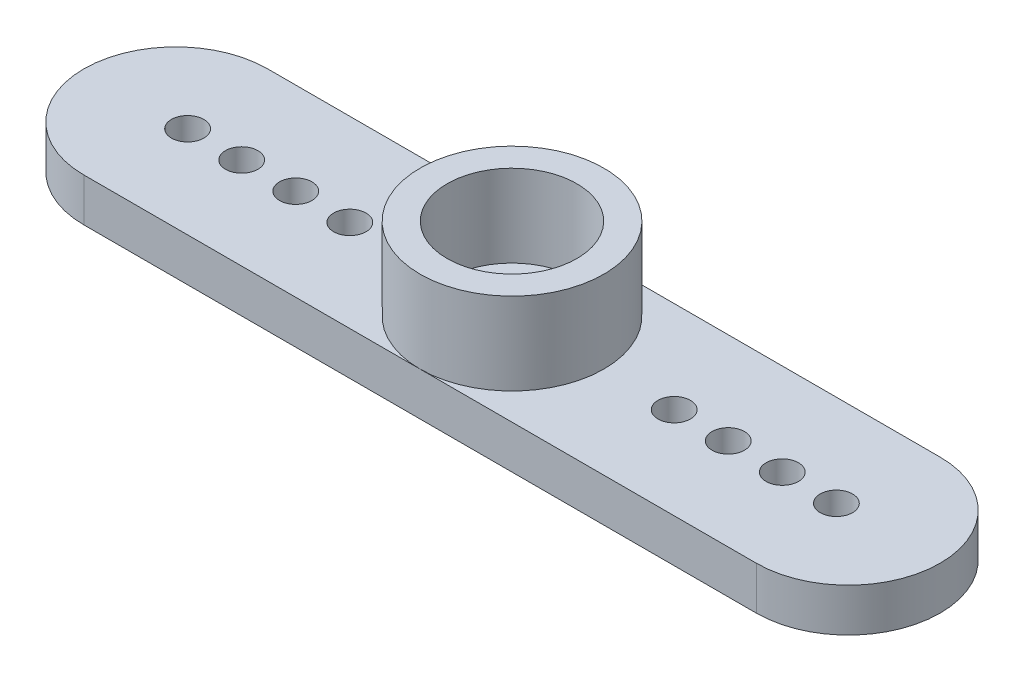
ISO-10303-21;
HEADER;
FILE_DESCRIPTION(('STEP AP214'),'2;1');
FILE_NAME('part.step','',(''),(''),'','','');
FILE_SCHEMA(('AUTOMOTIVE_DESIGN { 1 0 10303 214 1 1 1 1 }'));
ENDSEC;
DATA;
#1=APPLICATION_CONTEXT('core data for automotive mechanical design processes');
#2=APPLICATION_PROTOCOL_DEFINITION('international standard','automotive_design',2000,#1);
#3=PRODUCT_CONTEXT('',#1,'mechanical');
#4=PRODUCT('Part','Part','',(#3));
#5=PRODUCT_RELATED_PRODUCT_CATEGORY('part','',(#4));
#6=PRODUCT_DEFINITION_FORMATION('','',#4);
#7=PRODUCT_DEFINITION_CONTEXT('part definition',#1,'design');
#8=PRODUCT_DEFINITION('design','',#6,#7);
#9=PRODUCT_DEFINITION_SHAPE('','',#8);
#10=(LENGTH_UNIT() NAMED_UNIT(*) SI_UNIT(.MILLI.,.METRE.));
#11=(NAMED_UNIT(*) PLANE_ANGLE_UNIT() SI_UNIT($,.RADIAN.));
#12=(NAMED_UNIT(*) SI_UNIT($,.STERADIAN.) SOLID_ANGLE_UNIT());
#13=UNCERTAINTY_MEASURE_WITH_UNIT(LENGTH_MEASURE(1.E-05),#10,'distance_accuracy_value','');
#14=(GEOMETRIC_REPRESENTATION_CONTEXT(3) GLOBAL_UNCERTAINTY_ASSIGNED_CONTEXT((#13)) GLOBAL_UNIT_ASSIGNED_CONTEXT((#10,
#11,#12)) REPRESENTATION_CONTEXT('',''));
#15=CARTESIAN_POINT('',(0.,0.,0.));
#16=DIRECTION('',(0.,0.,1.));
#17=DIRECTION('',(1.,0.,0.));
#18=AXIS2_PLACEMENT_3D('',#15,#16,#17);
#19=CARTESIAN_POINT('',(0.,2.,0.));
#20=DIRECTION('',(0.,1.,0.));
#21=DIRECTION('',(0.,0.,1.));
#22=AXIS2_PLACEMENT_3D('',#19,#20,#21);
#23=PLANE('',#22);
#24=CARTESIAN_POINT('',(15.55,2.,0.));
#25=DIRECTION('',(0.,1.,0.));
#26=DIRECTION('',(0.,0.,1.));
#27=AXIS2_PLACEMENT_3D('',#24,#25,#26);
#28=CIRCLE('',#27,4.25);
#29=CARTESIAN_POINT('',(15.55,2.,4.25));
#30=VERTEX_POINT('',#29);
#31=CARTESIAN_POINT('',(15.55,2.,-4.25));
#32=VERTEX_POINT('',#31);
#33=EDGE_CURVE('E45',#30,#32,#28,.T.);
#34=ORIENTED_EDGE('',*,*,#33,.F.);
#35=DIRECTION('',(1.,0.,0.));
#36=VECTOR('',#35,1.);
#37=CARTESIAN_POINT('',(0.,2.,4.25));
#38=LINE('',#37,#36);
#39=CARTESIAN_POINT('',(31.1,2.,4.25));
#40=VERTEX_POINT('',#39);
#41=EDGE_CURVE('E93',#30,#40,#38,.T.);
#42=ORIENTED_EDGE('',*,*,#41,.T.);
#43=CARTESIAN_POINT('',(31.1,2.,0.));
#44=DIRECTION('',(0.,1.,0.));
#45=DIRECTION('',(0.,0.,1.));
#46=AXIS2_PLACEMENT_3D('',#43,#44,#45);
#47=CIRCLE('',#46,4.25);
#48=CARTESIAN_POINT('',(31.1,2.,-4.25));
#49=VERTEX_POINT('',#48);
#50=EDGE_CURVE('E92',#40,#49,#47,.T.);
#51=ORIENTED_EDGE('',*,*,#50,.T.);
#52=DIRECTION('',(-1.,0.,0.));
#53=VECTOR('',#52,1.);
#54=CARTESIAN_POINT('',(0.,2.,-4.25));
#55=LINE('',#54,#53);
#56=EDGE_CURVE('E106',#49,#32,#55,.T.);
#57=ORIENTED_EDGE('',*,*,#56,.T.);
#58=EDGE_LOOP('',(#34,#42,#51,#57));
#59=FACE_BOUND('',#58,.T.);
#60=CARTESIAN_POINT('',(28.05,2.,0.));
#61=DIRECTION('',(0.,1.,0.));
#62=DIRECTION('',(0.,0.,1.));
#63=AXIS2_PLACEMENT_3D('',#60,#61,#62);
#64=CIRCLE('',#63,0.750000000000002);
#65=CARTESIAN_POINT('',(28.05,2.,0.750000000000002));
#66=VERTEX_POINT('',#65);
#67=EDGE_CURVE('E189',#66,#66,#64,.T.);
#68=ORIENTED_EDGE('',*,*,#67,.F.);
#69=EDGE_LOOP('',(#68));
#70=FACE_BOUND('',#69,.T.);
#71=CARTESIAN_POINT('',(23.05,2.,0.));
#72=DIRECTION('',(0.,1.,0.));
#73=DIRECTION('',(0.,0.,1.));
#74=AXIS2_PLACEMENT_3D('',#71,#72,#73);
#75=CIRCLE('',#74,0.750000000000002);
#76=CARTESIAN_POINT('',(23.05,2.,0.750000000000002));
#77=VERTEX_POINT('',#76);
#78=EDGE_CURVE('E178',#77,#77,#75,.T.);
#79=ORIENTED_EDGE('',*,*,#78,.F.);
#80=EDGE_LOOP('',(#79));
#81=FACE_BOUND('',#80,.T.);
#82=CARTESIAN_POINT('',(25.55,2.,0.));
#83=DIRECTION('',(0.,1.,0.));
#84=DIRECTION('',(0.,0.,1.));
#85=AXIS2_PLACEMENT_3D('',#82,#83,#84);
#86=CIRCLE('',#85,0.750000000000002);
#87=CARTESIAN_POINT('',(25.55,2.,0.750000000000002));
#88=VERTEX_POINT('',#87);
#89=EDGE_CURVE('E183',#88,#88,#86,.T.);
#90=ORIENTED_EDGE('',*,*,#89,.F.);
#91=EDGE_LOOP('',(#90));
#92=FACE_BOUND('',#91,.T.);
#93=CARTESIAN_POINT('',(30.55,2.,0.));
#94=DIRECTION('',(0.,1.,0.));
#95=DIRECTION('',(0.,0.,1.));
#96=AXIS2_PLACEMENT_3D('',#93,#94,#95);
#97=CIRCLE('',#96,0.750000000000005);
#98=CARTESIAN_POINT('',(30.55,2.,0.750000000000005));
#99=VERTEX_POINT('',#98);
#100=EDGE_CURVE('E195',#99,#99,#97,.T.);
#101=ORIENTED_EDGE('',*,*,#100,.F.);
#102=EDGE_LOOP('',(#101));
#103=FACE_BOUND('',#102,.T.);
#104=ADVANCED_FACE('F35',(#59,#70,#81,#92,#103),#23,.T.);
#105=EDGE_CURVE('E11',#32,#30,#28,.T.);
#106=ORIENTED_EDGE('',*,*,#105,.F.);
#107=CARTESIAN_POINT('',(0.,2.,-4.25));
#108=VERTEX_POINT('',#107);
#109=EDGE_CURVE('E55',#32,#108,#55,.T.);
#110=ORIENTED_EDGE('',*,*,#109,.T.);
#111=CARTESIAN_POINT('',(0.,2.,0.));
#112=DIRECTION('',(0.,1.,0.));
#113=DIRECTION('',(0.,0.,1.));
#114=AXIS2_PLACEMENT_3D('',#111,#112,#113);
#115=CIRCLE('',#114,4.25);
#116=CARTESIAN_POINT('',(0.,2.,4.25));
#117=VERTEX_POINT('',#116);
#118=EDGE_CURVE('E90',#108,#117,#115,.T.);
#119=ORIENTED_EDGE('',*,*,#118,.T.);
#120=EDGE_CURVE('E84',#117,#30,#38,.T.);
#121=ORIENTED_EDGE('',*,*,#120,.T.);
#122=EDGE_LOOP('',(#106,#110,#119,#121));
#123=FACE_BOUND('',#122,.T.);
#124=CARTESIAN_POINT('',(3.05,2.,0.));
#125=DIRECTION('',(0.,1.,0.));
#126=DIRECTION('',(0.,0.,1.));
#127=AXIS2_PLACEMENT_3D('',#124,#125,#126);
#128=CIRCLE('',#127,0.75);
#129=CARTESIAN_POINT('',(3.05,2.,0.750000000000035));
#130=VERTEX_POINT('',#129);
#131=EDGE_CURVE('E207',#130,#130,#128,.T.);
#132=ORIENTED_EDGE('',*,*,#131,.F.);
#133=EDGE_LOOP('',(#132));
#134=FACE_BOUND('',#133,.T.);
#135=CARTESIAN_POINT('',(8.05,2.,0.));
#136=DIRECTION('',(0.,1.,0.));
#137=DIRECTION('',(0.,0.,1.));
#138=AXIS2_PLACEMENT_3D('',#135,#136,#137);
#139=CIRCLE('',#138,0.75);
#140=CARTESIAN_POINT('',(8.05,2.,0.75));
#141=VERTEX_POINT('',#140);
#142=EDGE_CURVE('E158',#141,#141,#139,.T.);
#143=ORIENTED_EDGE('',*,*,#142,.F.);
#144=EDGE_LOOP('',(#143));
#145=FACE_BOUND('',#144,.T.);
#146=CARTESIAN_POINT('',(5.55,2.,0.));
#147=DIRECTION('',(0.,1.,0.));
#148=DIRECTION('',(0.,0.,1.));
#149=AXIS2_PLACEMENT_3D('',#146,#147,#148);
#150=CIRCLE('',#149,0.75);
#151=CARTESIAN_POINT('',(5.55,2.,0.750000000000018));
#152=VERTEX_POINT('',#151);
#153=EDGE_CURVE('E201',#152,#152,#150,.T.);
#154=ORIENTED_EDGE('',*,*,#153,.F.);
#155=EDGE_LOOP('',(#154));
#156=FACE_BOUND('',#155,.T.);
#157=CARTESIAN_POINT('',(0.550000000000004,2.,0.));
#158=DIRECTION('',(0.,1.,0.));
#159=DIRECTION('',(0.,0.,1.));
#160=AXIS2_PLACEMENT_3D('',#157,#158,#159);
#161=CIRCLE('',#160,0.75);
#162=CARTESIAN_POINT('',(0.550000000000004,2.,0.750000000000053));
#163=VERTEX_POINT('',#162);
#164=EDGE_CURVE('E213',#163,#163,#161,.T.);
#165=ORIENTED_EDGE('',*,*,#164,.F.);
#166=EDGE_LOOP('',(#165));
#167=FACE_BOUND('',#166,.T.);
#168=ADVANCED_FACE('F87',(#123,#134,#145,#156,#167),#23,.T.);
#169=CARTESIAN_POINT('',(0.,0.,0.));
#170=DIRECTION('',(0.,1.,0.));
#171=DIRECTION('',(0.,0.,1.));
#172=AXIS2_PLACEMENT_3D('',#169,#170,#171);
#173=PLANE('',#172);
#174=CARTESIAN_POINT('',(0.,0.,0.));
#175=DIRECTION('',(0.,1.,0.));
#176=DIRECTION('',(0.,0.,1.));
#177=AXIS2_PLACEMENT_3D('',#174,#175,#176);
#178=CIRCLE('',#177,4.25);
#179=CARTESIAN_POINT('',(0.,0.,-4.25));
#180=VERTEX_POINT('',#179);
#181=CARTESIAN_POINT('',(0.,0.,4.25));
#182=VERTEX_POINT('',#181);
#183=EDGE_CURVE('E155',#180,#182,#178,.T.);
#184=ORIENTED_EDGE('',*,*,#183,.F.);
#185=DIRECTION('',(-1.,0.,0.));
#186=VECTOR('',#185,1.);
#187=CARTESIAN_POINT('',(0.,0.,-4.25));
#188=LINE('',#187,#186);
#189=CARTESIAN_POINT('',(31.1,0.,-4.25));
#190=VERTEX_POINT('',#189);
#191=EDGE_CURVE('E77',#190,#180,#188,.T.);
#192=ORIENTED_EDGE('',*,*,#191,.F.);
#193=CARTESIAN_POINT('',(31.1,0.,0.));
#194=DIRECTION('',(0.,1.,0.));
#195=DIRECTION('',(0.,0.,1.));
#196=AXIS2_PLACEMENT_3D('',#193,#194,#195);
#197=CIRCLE('',#196,4.25);
#198=CARTESIAN_POINT('',(31.1,0.,4.25));
#199=VERTEX_POINT('',#198);
#200=EDGE_CURVE('E160',#199,#190,#197,.T.);
#201=ORIENTED_EDGE('',*,*,#200,.F.);
#202=DIRECTION('',(1.,0.,0.));
#203=VECTOR('',#202,1.);
#204=CARTESIAN_POINT('',(0.,0.,4.25));
#205=LINE('',#204,#203);
#206=EDGE_CURVE('E157',#182,#199,#205,.T.);
#207=ORIENTED_EDGE('',*,*,#206,.F.);
#208=EDGE_LOOP('',(#184,#192,#201,#207));
#209=FACE_BOUND('',#208,.T.);
#210=CARTESIAN_POINT('',(8.05,0.,0.));
#211=DIRECTION('',(0.,1.,0.));
#212=DIRECTION('',(0.,0.,1.));
#213=AXIS2_PLACEMENT_3D('',#210,#211,#212);
#214=CIRCLE('',#213,0.75);
#215=CARTESIAN_POINT('',(8.05,0.,0.75));
#216=VERTEX_POINT('',#215);
#217=EDGE_CURVE('E163',#216,#216,#214,.T.);
#218=ORIENTED_EDGE('',*,*,#217,.T.);
#219=EDGE_LOOP('',(#218));
#220=FACE_BOUND('',#219,.T.);
#221=CARTESIAN_POINT('',(23.05,0.,0.));
#222=DIRECTION('',(0.,1.,0.));
#223=DIRECTION('',(0.,0.,1.));
#224=AXIS2_PLACEMENT_3D('',#221,#222,#223);
#225=CIRCLE('',#224,0.750000000000002);
#226=CARTESIAN_POINT('',(23.05,0.,0.750000000000002));
#227=VERTEX_POINT('',#226);
#228=EDGE_CURVE('E180',#227,#227,#225,.T.);
#229=ORIENTED_EDGE('',*,*,#228,.T.);
#230=EDGE_LOOP('',(#229));
#231=FACE_BOUND('',#230,.T.);
#232=CARTESIAN_POINT('',(25.55,0.,0.));
#233=DIRECTION('',(0.,1.,0.));
#234=DIRECTION('',(0.,0.,1.));
#235=AXIS2_PLACEMENT_3D('',#232,#233,#234);
#236=CIRCLE('',#235,0.750000000000002);
#237=CARTESIAN_POINT('',(25.55,0.,0.750000000000002));
#238=VERTEX_POINT('',#237);
#239=EDGE_CURVE('E186',#238,#238,#236,.T.);
#240=ORIENTED_EDGE('',*,*,#239,.T.);
#241=EDGE_LOOP('',(#240));
#242=FACE_BOUND('',#241,.T.);
#243=CARTESIAN_POINT('',(28.05,0.,0.));
#244=DIRECTION('',(0.,1.,0.));
#245=DIRECTION('',(0.,0.,1.));
#246=AXIS2_PLACEMENT_3D('',#243,#244,#245);
#247=CIRCLE('',#246,0.750000000000002);
#248=CARTESIAN_POINT('',(28.05,0.,0.750000000000002));
#249=VERTEX_POINT('',#248);
#250=EDGE_CURVE('E192',#249,#249,#247,.T.);
#251=ORIENTED_EDGE('',*,*,#250,.T.);
#252=EDGE_LOOP('',(#251));
#253=FACE_BOUND('',#252,.T.);
#254=CARTESIAN_POINT('',(30.55,0.,0.));
#255=DIRECTION('',(0.,1.,0.));
#256=DIRECTION('',(0.,0.,1.));
#257=AXIS2_PLACEMENT_3D('',#254,#255,#256);
#258=CIRCLE('',#257,0.750000000000005);
#259=CARTESIAN_POINT('',(30.55,0.,0.750000000000005));
#260=VERTEX_POINT('',#259);
#261=EDGE_CURVE('E198',#260,#260,#258,.T.);
#262=ORIENTED_EDGE('',*,*,#261,.T.);
#263=EDGE_LOOP('',(#262));
#264=FACE_BOUND('',#263,.T.);
#265=CARTESIAN_POINT('',(5.55,0.,0.));
#266=DIRECTION('',(0.,1.,0.));
#267=DIRECTION('',(0.,0.,1.));
#268=AXIS2_PLACEMENT_3D('',#265,#266,#267);
#269=CIRCLE('',#268,0.75);
#270=CARTESIAN_POINT('',(5.55,0.,0.750000000000018));
#271=VERTEX_POINT('',#270);
#272=EDGE_CURVE('E204',#271,#271,#269,.T.);
#273=ORIENTED_EDGE('',*,*,#272,.T.);
#274=EDGE_LOOP('',(#273));
#275=FACE_BOUND('',#274,.T.);
#276=CARTESIAN_POINT('',(3.05,0.,0.));
#277=DIRECTION('',(0.,1.,0.));
#278=DIRECTION('',(0.,0.,1.));
#279=AXIS2_PLACEMENT_3D('',#276,#277,#278);
#280=CIRCLE('',#279,0.75);
#281=CARTESIAN_POINT('',(3.05,0.,0.750000000000035));
#282=VERTEX_POINT('',#281);
#283=EDGE_CURVE('E210',#282,#282,#280,.T.);
#284=ORIENTED_EDGE('',*,*,#283,.T.);
#285=EDGE_LOOP('',(#284));
#286=FACE_BOUND('',#285,.T.);
#287=CARTESIAN_POINT('',(0.550000000000004,0.,0.));
#288=DIRECTION('',(0.,1.,0.));
#289=DIRECTION('',(0.,0.,1.));
#290=AXIS2_PLACEMENT_3D('',#287,#288,#289);
#291=CIRCLE('',#290,0.75);
#292=CARTESIAN_POINT('',(0.550000000000004,0.,0.750000000000053));
#293=VERTEX_POINT('',#292);
#294=EDGE_CURVE('E216',#293,#293,#291,.T.);
#295=ORIENTED_EDGE('',*,*,#294,.T.);
#296=EDGE_LOOP('',(#295));
#297=FACE_BOUND('',#296,.T.);
#298=ADVANCED_FACE('F132',(#209,#220,#231,#242,#253,#264,#275,#286,#297),#173,.F.);
#299=CARTESIAN_POINT('',(0.,2.,0.));
#300=DIRECTION('',(0.,-1.,0.));
#301=DIRECTION('',(0.,0.,-1.));
#302=AXIS2_PLACEMENT_3D('',#299,#300,#301);
#303=CYLINDRICAL_SURFACE('',#302,4.25);
#304=ORIENTED_EDGE('',*,*,#183,.T.);
#305=DIRECTION('',(0.,-1.,0.));
#306=VECTOR('',#305,1.);
#307=CARTESIAN_POINT('',(0.,2.,4.25));
#308=LINE('',#307,#306);
#309=EDGE_CURVE('E39',#117,#182,#308,.T.);
#310=ORIENTED_EDGE('',*,*,#309,.F.);
#311=ORIENTED_EDGE('',*,*,#118,.F.);
#312=DIRECTION('',(0.,-1.,0.));
#313=VECTOR('',#312,1.);
#314=CARTESIAN_POINT('',(0.,2.,-4.25));
#315=LINE('',#314,#313);
#316=EDGE_CURVE('E156',#108,#180,#315,.T.);
#317=ORIENTED_EDGE('',*,*,#316,.T.);
#318=EDGE_LOOP('',(#304,#310,#311,#317));
#319=FACE_BOUND('',#318,.T.);
#320=ADVANCED_FACE('F37',(#319),#303,.T.);
#321=CARTESIAN_POINT('',(0.,2.,4.25));
#322=DIRECTION('',(0.,0.,-1.));
#323=DIRECTION('',(-1.,0.,0.));
#324=AXIS2_PLACEMENT_3D('',#321,#322,#323);
#325=PLANE('',#324);
#326=ORIENTED_EDGE('',*,*,#206,.T.);
#327=DIRECTION('',(0.,-1.,0.));
#328=VECTOR('',#327,1.);
#329=CARTESIAN_POINT('',(31.1,2.,4.25));
#330=LINE('',#329,#328);
#331=EDGE_CURVE('E99',#40,#199,#330,.T.);
#332=ORIENTED_EDGE('',*,*,#331,.F.);
#333=ORIENTED_EDGE('',*,*,#41,.F.);
#334=ORIENTED_EDGE('',*,*,#120,.F.);
#335=ORIENTED_EDGE('',*,*,#309,.T.);
#336=EDGE_LOOP('',(#326,#332,#333,#334,#335));
#337=FACE_BOUND('',#336,.T.);
#338=ADVANCED_FACE('F97',(#337),#325,.F.);
#339=CARTESIAN_POINT('',(31.1,2.,0.));
#340=DIRECTION('',(0.,-1.,0.));
#341=DIRECTION('',(0.,0.,-1.));
#342=AXIS2_PLACEMENT_3D('',#339,#340,#341);
#343=CYLINDRICAL_SURFACE('',#342,4.25);
#344=ORIENTED_EDGE('',*,*,#200,.T.);
#345=DIRECTION('',(0.,-1.,0.));
#346=VECTOR('',#345,1.);
#347=CARTESIAN_POINT('',(31.1,2.,-4.25));
#348=LINE('',#347,#346);
#349=EDGE_CURVE('E171',#49,#190,#348,.T.);
#350=ORIENTED_EDGE('',*,*,#349,.F.);
#351=ORIENTED_EDGE('',*,*,#50,.F.);
#352=ORIENTED_EDGE('',*,*,#331,.T.);
#353=EDGE_LOOP('',(#344,#350,#351,#352));
#354=FACE_BOUND('',#353,.T.);
#355=ADVANCED_FACE('F143',(#354),#343,.T.);
#356=CARTESIAN_POINT('',(0.,2.,-4.25));
#357=DIRECTION('',(0.,0.,1.));
#358=DIRECTION('',(1.,0.,0.));
#359=AXIS2_PLACEMENT_3D('',#356,#357,#358);
#360=PLANE('',#359);
#361=ORIENTED_EDGE('',*,*,#191,.T.);
#362=ORIENTED_EDGE('',*,*,#316,.F.);
#363=ORIENTED_EDGE('',*,*,#109,.F.);
#364=ORIENTED_EDGE('',*,*,#56,.F.);
#365=ORIENTED_EDGE('',*,*,#349,.T.);
#366=EDGE_LOOP('',(#361,#362,#363,#364,#365));
#367=FACE_BOUND('',#366,.T.);
#368=ADVANCED_FACE('F140',(#367),#360,.F.);
#369=CARTESIAN_POINT('',(8.05,2.,0.));
#370=DIRECTION('',(0.,-1.,0.));
#371=DIRECTION('',(0.,0.,-1.));
#372=AXIS2_PLACEMENT_3D('',#369,#370,#371);
#373=CYLINDRICAL_SURFACE('',#372,0.75);
#374=ORIENTED_EDGE('',*,*,#142,.T.);
#375=EDGE_LOOP('',(#374));
#376=FACE_BOUND('',#375,.T.);
#377=ORIENTED_EDGE('',*,*,#217,.F.);
#378=EDGE_LOOP('',(#377));
#379=FACE_BOUND('',#378,.T.);
#380=ADVANCED_FACE('F135',(#376,#379),#373,.F.);
#381=CARTESIAN_POINT('',(23.05,2.,0.));
#382=DIRECTION('',(0.,-1.,0.));
#383=DIRECTION('',(0.,0.,-1.));
#384=AXIS2_PLACEMENT_3D('',#381,#382,#383);
#385=CYLINDRICAL_SURFACE('',#384,0.750000000000002);
#386=ORIENTED_EDGE('',*,*,#78,.T.);
#387=EDGE_LOOP('',(#386));
#388=FACE_BOUND('',#387,.T.);
#389=ORIENTED_EDGE('',*,*,#228,.F.);
#390=EDGE_LOOP('',(#389));
#391=FACE_BOUND('',#390,.T.);
#392=ADVANCED_FACE('F336',(#388,#391),#385,.F.);
#393=CARTESIAN_POINT('',(25.55,2.,0.));
#394=DIRECTION('',(0.,-1.,0.));
#395=DIRECTION('',(0.,0.,-1.));
#396=AXIS2_PLACEMENT_3D('',#393,#394,#395);
#397=CYLINDRICAL_SURFACE('',#396,0.750000000000002);
#398=ORIENTED_EDGE('',*,*,#89,.T.);
#399=EDGE_LOOP('',(#398));
#400=FACE_BOUND('',#399,.T.);
#401=ORIENTED_EDGE('',*,*,#239,.F.);
#402=EDGE_LOOP('',(#401));
#403=FACE_BOUND('',#402,.T.);
#404=ADVANCED_FACE('F326',(#400,#403),#397,.F.);
#405=CARTESIAN_POINT('',(28.05,2.,0.));
#406=DIRECTION('',(0.,-1.,0.));
#407=DIRECTION('',(0.,0.,-1.));
#408=AXIS2_PLACEMENT_3D('',#405,#406,#407);
#409=CYLINDRICAL_SURFACE('',#408,0.750000000000002);
#410=ORIENTED_EDGE('',*,*,#67,.T.);
#411=EDGE_LOOP('',(#410));
#412=FACE_BOUND('',#411,.T.);
#413=ORIENTED_EDGE('',*,*,#250,.F.);
#414=EDGE_LOOP('',(#413));
#415=FACE_BOUND('',#414,.T.);
#416=ADVANCED_FACE('F316',(#412,#415),#409,.F.);
#417=CARTESIAN_POINT('',(30.55,2.,0.));
#418=DIRECTION('',(0.,-1.,0.));
#419=DIRECTION('',(0.,0.,-1.));
#420=AXIS2_PLACEMENT_3D('',#417,#418,#419);
#421=CYLINDRICAL_SURFACE('',#420,0.750000000000005);
#422=ORIENTED_EDGE('',*,*,#100,.T.);
#423=EDGE_LOOP('',(#422));
#424=FACE_BOUND('',#423,.T.);
#425=ORIENTED_EDGE('',*,*,#261,.F.);
#426=EDGE_LOOP('',(#425));
#427=FACE_BOUND('',#426,.T.);
#428=ADVANCED_FACE('F306',(#424,#427),#421,.F.);
#429=CARTESIAN_POINT('',(5.55,2.,0.));
#430=DIRECTION('',(0.,-1.,0.));
#431=DIRECTION('',(0.,0.,-1.));
#432=AXIS2_PLACEMENT_3D('',#429,#430,#431);
#433=CYLINDRICAL_SURFACE('',#432,0.75);
#434=ORIENTED_EDGE('',*,*,#153,.T.);
#435=EDGE_LOOP('',(#434));
#436=FACE_BOUND('',#435,.T.);
#437=ORIENTED_EDGE('',*,*,#272,.F.);
#438=EDGE_LOOP('',(#437));
#439=FACE_BOUND('',#438,.T.);
#440=ADVANCED_FACE('F296',(#436,#439),#433,.F.);
#441=CARTESIAN_POINT('',(3.05,2.,0.));
#442=DIRECTION('',(0.,-1.,0.));
#443=DIRECTION('',(0.,0.,-1.));
#444=AXIS2_PLACEMENT_3D('',#441,#442,#443);
#445=CYLINDRICAL_SURFACE('',#444,0.75);
#446=ORIENTED_EDGE('',*,*,#131,.T.);
#447=EDGE_LOOP('',(#446));
#448=FACE_BOUND('',#447,.T.);
#449=ORIENTED_EDGE('',*,*,#283,.F.);
#450=EDGE_LOOP('',(#449));
#451=FACE_BOUND('',#450,.T.);
#452=ADVANCED_FACE('F123',(#448,#451),#445,.F.);
#453=CARTESIAN_POINT('',(0.550000000000004,2.,0.));
#454=DIRECTION('',(0.,-1.,0.));
#455=DIRECTION('',(0.,0.,-1.));
#456=AXIS2_PLACEMENT_3D('',#453,#454,#455);
#457=CYLINDRICAL_SURFACE('',#456,0.75);
#458=ORIENTED_EDGE('',*,*,#164,.T.);
#459=EDGE_LOOP('',(#458));
#460=FACE_BOUND('',#459,.T.);
#461=ORIENTED_EDGE('',*,*,#294,.F.);
#462=EDGE_LOOP('',(#461));
#463=FACE_BOUND('',#462,.T.);
#464=ADVANCED_FACE('F113',(#460,#463),#457,.F.);
#465=CARTESIAN_POINT('',(15.55,5.8,0.));
#466=DIRECTION('',(0.,-1.,0.));
#467=DIRECTION('',(0.,0.,-1.));
#468=AXIS2_PLACEMENT_3D('',#465,#466,#467);
#469=CYLINDRICAL_SURFACE('',#468,4.25);
#470=CARTESIAN_POINT('',(15.55,5.8,0.));
#471=DIRECTION('',(0.,1.,0.));
#472=DIRECTION('',(0.,0.,1.));
#473=AXIS2_PLACEMENT_3D('',#470,#471,#472);
#474=CIRCLE('',#473,4.25);
#475=CARTESIAN_POINT('',(15.55,5.8,4.25));
#476=VERTEX_POINT('',#475);
#477=EDGE_CURVE('E108',#476,#476,#474,.T.);
#478=ORIENTED_EDGE('',*,*,#477,.F.);
#479=EDGE_LOOP('',(#478));
#480=FACE_BOUND('',#479,.T.);
#481=ORIENTED_EDGE('',*,*,#33,.T.);
#482=ORIENTED_EDGE('',*,*,#105,.T.);
#483=EDGE_LOOP('',(#481,#482));
#484=FACE_BOUND('',#483,.T.);
#485=ADVANCED_FACE('F110',(#480,#484),#469,.T.);
#486=CARTESIAN_POINT('',(15.55,5.8,0.));
#487=DIRECTION('',(0.,1.,0.));
#488=DIRECTION('',(0.,0.,1.));
#489=AXIS2_PLACEMENT_3D('',#486,#487,#488);
#490=PLANE('',#489);
#491=CARTESIAN_POINT('',(15.55,5.8,0.));
#492=DIRECTION('',(0.,1.,0.));
#493=DIRECTION('',(0.,0.,1.));
#494=AXIS2_PLACEMENT_3D('',#491,#492,#493);
#495=CIRCLE('',#494,3.);
#496=CARTESIAN_POINT('',(15.55,5.8,3.));
#497=VERTEX_POINT('',#496);
#498=EDGE_CURVE('E223',#497,#497,#495,.T.);
#499=ORIENTED_EDGE('',*,*,#498,.F.);
#500=EDGE_LOOP('',(#499));
#501=FACE_BOUND('',#500,.T.);
#502=ORIENTED_EDGE('',*,*,#477,.T.);
#503=EDGE_LOOP('',(#502));
#504=FACE_BOUND('',#503,.T.);
#505=ADVANCED_FACE('F112',(#501,#504),#490,.T.);
#506=CARTESIAN_POINT('',(15.55,2.,0.));
#507=DIRECTION('',(0.,1.,0.));
#508=DIRECTION('',(0.,0.,1.));
#509=AXIS2_PLACEMENT_3D('',#506,#507,#508);
#510=CYLINDRICAL_SURFACE('',#509,3.);
#511=CARTESIAN_POINT('',(15.55,2.,0.));
#512=DIRECTION('',(0.,1.,0.));
#513=DIRECTION('',(0.,0.,1.));
#514=AXIS2_PLACEMENT_3D('',#511,#512,#513);
#515=CIRCLE('',#514,3.);
#516=CARTESIAN_POINT('',(15.55,2.,3.));
#517=VERTEX_POINT('',#516);
#518=EDGE_CURVE('E109',#517,#517,#515,.T.);
#519=ORIENTED_EDGE('',*,*,#518,.F.);
#520=EDGE_LOOP('',(#519));
#521=FACE_BOUND('',#520,.T.);
#522=ORIENTED_EDGE('',*,*,#498,.T.);
#523=EDGE_LOOP('',(#522));
#524=FACE_BOUND('',#523,.T.);
#525=ADVANCED_FACE('F120',(#521,#524),#510,.F.);
#526=CARTESIAN_POINT('',(15.55,2.,0.));
#527=DIRECTION('',(0.,1.,0.));
#528=DIRECTION('',(0.,0.,1.));
#529=AXIS2_PLACEMENT_3D('',#526,#527,#528);
#530=PLANE('',#529);
#531=ORIENTED_EDGE('',*,*,#518,.T.);
#532=EDGE_LOOP('',(#531));
#533=FACE_BOUND('',#532,.T.);
#534=ADVANCED_FACE('F229',(#533),#530,.T.);
#535=CLOSED_SHELL('',(#104,#168,#298,#320,#338,#355,#368,#380,#392,#404,#416,#428,#440,#452,
#464,#485,#505,#525,#534));
#536=MANIFOLD_SOLID_BREP('B2',#535);
#537=ADVANCED_BREP_SHAPE_REPRESENTATION('',(#18,#536),#14);
#538=SHAPE_DEFINITION_REPRESENTATION(#9,#537);
ENDSEC;
END-ISO-10303-21;
